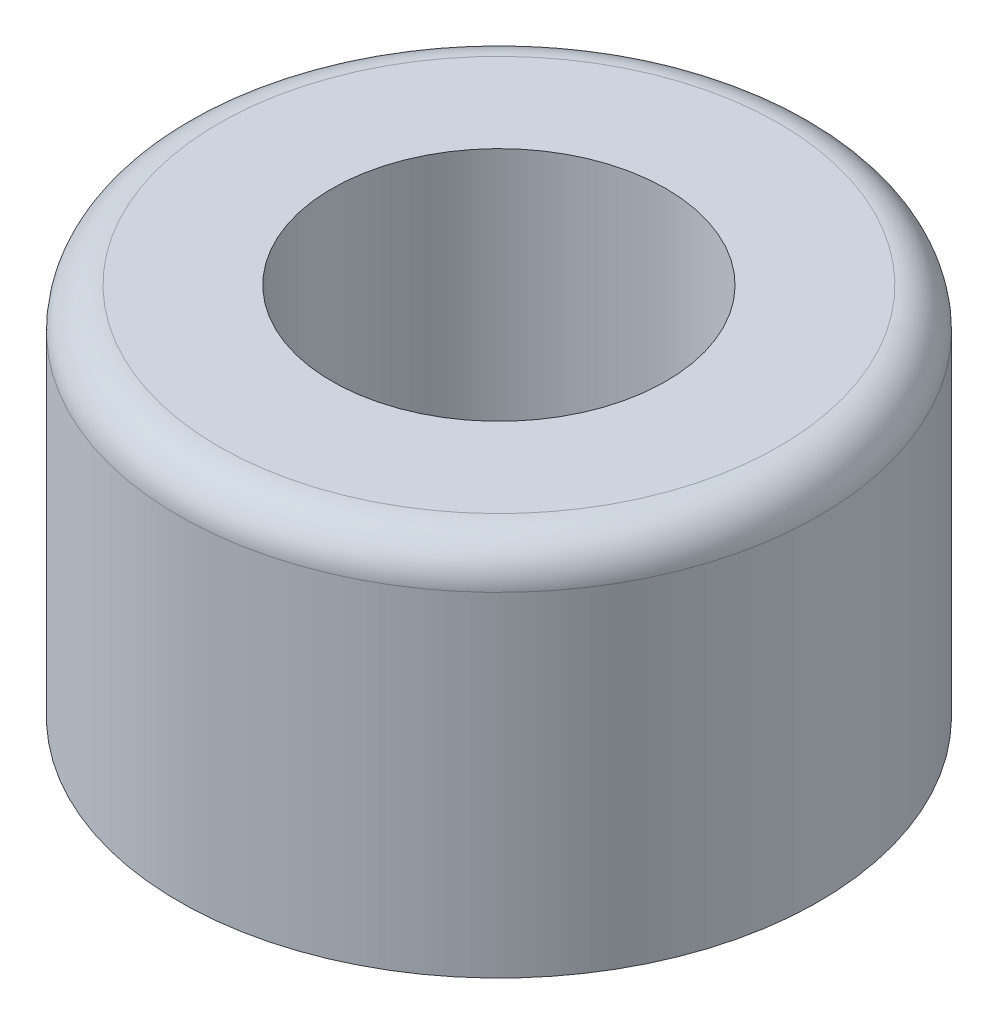
ISO-10303-21;
HEADER;
FILE_DESCRIPTION(('STEP AP214'),'2;1');
FILE_NAME('part.step','',(''),(''),'','','');
FILE_SCHEMA(('AUTOMOTIVE_DESIGN { 1 0 10303 214 1 1 1 1 }'));
ENDSEC;
DATA;
#1=APPLICATION_CONTEXT('core data for automotive mechanical design processes');
#2=APPLICATION_PROTOCOL_DEFINITION('international standard','automotive_design',2000,#1);
#3=PRODUCT_CONTEXT('',#1,'mechanical');
#4=PRODUCT('Part','Part','',(#3));
#5=PRODUCT_RELATED_PRODUCT_CATEGORY('part','',(#4));
#6=PRODUCT_DEFINITION_FORMATION('','',#4);
#7=PRODUCT_DEFINITION_CONTEXT('part definition',#1,'design');
#8=PRODUCT_DEFINITION('design','',#6,#7);
#9=PRODUCT_DEFINITION_SHAPE('','',#8);
#10=(LENGTH_UNIT() NAMED_UNIT(*) SI_UNIT(.MILLI.,.METRE.));
#11=(NAMED_UNIT(*) PLANE_ANGLE_UNIT() SI_UNIT($,.RADIAN.));
#12=(NAMED_UNIT(*) SI_UNIT($,.STERADIAN.) SOLID_ANGLE_UNIT());
#13=UNCERTAINTY_MEASURE_WITH_UNIT(LENGTH_MEASURE(1.E-05),#10,'distance_accuracy_value','');
#14=(GEOMETRIC_REPRESENTATION_CONTEXT(3) GLOBAL_UNCERTAINTY_ASSIGNED_CONTEXT((#13)) GLOBAL_UNIT_ASSIGNED_CONTEXT((#10,
#11,#12)) REPRESENTATION_CONTEXT('',''));
#15=CARTESIAN_POINT('',(0.,0.,0.));
#16=DIRECTION('',(0.,0.,1.));
#17=DIRECTION('',(1.,0.,0.));
#18=AXIS2_PLACEMENT_3D('',#15,#16,#17);
#19=CARTESIAN_POINT('',(0.,2.3749,0.));
#20=DIRECTION('',(0.,1.,0.));
#21=DIRECTION('',(0.,0.,1.));
#22=AXIS2_PLACEMENT_3D('',#19,#20,#21);
#23=PLANE('',#22);
#24=CARTESIAN_POINT('',(0.,2.3749,0.));
#25=DIRECTION('',(0.,-1.,0.));
#26=DIRECTION('',(0.,0.,-1.));
#27=AXIS2_PLACEMENT_3D('',#24,#25,#26);
#28=CIRCLE('',#27,2.1209);
#29=CARTESIAN_POINT('',(0.,2.3749,-2.1209));
#30=VERTEX_POINT('',#29);
#31=EDGE_CURVE('E40',#30,#30,#28,.T.);
#32=ORIENTED_EDGE('',*,*,#31,.T.);
#33=EDGE_LOOP('',(#32));
#34=FACE_BOUND('',#33,.T.);
#35=CARTESIAN_POINT('',(0.,2.3749,0.));
#36=DIRECTION('',(0.,-1.,0.));
#37=DIRECTION('',(0.,0.,-1.));
#38=AXIS2_PLACEMENT_3D('',#35,#36,#37);
#39=CIRCLE('',#38,3.556);
#40=CARTESIAN_POINT('',(0.,2.3749,-3.556));
#41=VERTEX_POINT('',#40);
#42=CARTESIAN_POINT('',(0.,2.3749,3.556));
#43=VERTEX_POINT('',#42);
#44=EDGE_CURVE('E34',#41,#43,#39,.T.);
#45=ORIENTED_EDGE('',*,*,#44,.F.);
#46=CARTESIAN_POINT('',(0.,2.3749,0.));
#47=DIRECTION('',(0.,-1.,0.));
#48=DIRECTION('',(0.,0.,1.));
#49=AXIS2_PLACEMENT_3D('',#46,#47,#48);
#50=CIRCLE('',#49,3.556);
#51=EDGE_CURVE('E38',#43,#41,#50,.T.);
#52=ORIENTED_EDGE('',*,*,#51,.F.);
#53=EDGE_LOOP('',(#45,#52));
#54=FACE_BOUND('',#53,.T.);
#55=ADVANCED_FACE('F16',(#34,#54),#23,.T.);
#56=CARTESIAN_POINT('',(0.,2.3749,0.));
#57=DIRECTION('',(0.,-1.,0.));
#58=DIRECTION('',(0.,0.,-1.));
#59=AXIS2_PLACEMENT_3D('',#56,#57,#58);
#60=CYLINDRICAL_SURFACE('',#59,2.1209);
#61=CARTESIAN_POINT('',(0.,-2.3749,0.));
#62=DIRECTION('',(0.,-1.,0.));
#63=DIRECTION('',(0.,0.,-1.));
#64=AXIS2_PLACEMENT_3D('',#61,#62,#63);
#65=CIRCLE('',#64,2.1209);
#66=CARTESIAN_POINT('',(0.,-2.3749,-2.1209));
#67=VERTEX_POINT('',#66);
#68=EDGE_CURVE('E45',#67,#67,#65,.T.);
#69=ORIENTED_EDGE('',*,*,#68,.T.);
#70=EDGE_LOOP('',(#69));
#71=FACE_BOUND('',#70,.T.);
#72=ORIENTED_EDGE('',*,*,#31,.F.);
#73=EDGE_LOOP('',(#72));
#74=FACE_BOUND('',#73,.T.);
#75=ADVANCED_FACE('F62',(#71,#74),#60,.F.);
#76=CARTESIAN_POINT('',(0.,1.8669,0.));
#77=DIRECTION('',(0.,1.,0.));
#78=DIRECTION('',(0.,0.,1.));
#79=AXIS2_PLACEMENT_3D('',#76,#77,#78);
#80=TOROIDAL_SURFACE('',#79,3.556,0.508);
#81=CARTESIAN_POINT('',(0.,1.8669,0.));
#82=DIRECTION('',(0.,-1.,0.));
#83=DIRECTION('',(0.,0.,-1.));
#84=AXIS2_PLACEMENT_3D('',#81,#82,#83);
#85=CIRCLE('',#84,4.064);
#86=CARTESIAN_POINT('',(0.,1.8669,-4.064));
#87=VERTEX_POINT('',#86);
#88=EDGE_CURVE('E28',#87,#87,#85,.T.);
#89=ORIENTED_EDGE('',*,*,#88,.F.);
#90=EDGE_LOOP('',(#89));
#91=FACE_BOUND('',#90,.T.);
#92=ORIENTED_EDGE('',*,*,#51,.T.);
#93=ORIENTED_EDGE('',*,*,#44,.T.);
#94=EDGE_LOOP('',(#92,#93));
#95=FACE_BOUND('',#94,.T.);
#96=ADVANCED_FACE('F44',(#91,#95),#80,.T.);
#97=CARTESIAN_POINT('',(0.,-2.3749,0.));
#98=DIRECTION('',(0.,1.,0.));
#99=DIRECTION('',(0.,0.,1.));
#100=AXIS2_PLACEMENT_3D('',#97,#98,#99);
#101=PLANE('',#100);
#102=ORIENTED_EDGE('',*,*,#68,.F.);
#103=EDGE_LOOP('',(#102));
#104=FACE_BOUND('',#103,.T.);
#105=CARTESIAN_POINT('',(0.,-2.3749,0.));
#106=DIRECTION('',(0.,-1.,0.));
#107=DIRECTION('',(0.,0.,-1.));
#108=AXIS2_PLACEMENT_3D('',#105,#106,#107);
#109=CIRCLE('',#108,4.064);
#110=CARTESIAN_POINT('',(0.,-2.3749,-4.064));
#111=VERTEX_POINT('',#110);
#112=EDGE_CURVE('E11',#111,#111,#109,.F.);
#113=ORIENTED_EDGE('',*,*,#112,.F.);
#114=EDGE_LOOP('',(#113));
#115=FACE_BOUND('',#114,.T.);
#116=ADVANCED_FACE('F61',(#104,#115),#101,.F.);
#117=CARTESIAN_POINT('',(0.,2.3749,0.));
#118=DIRECTION('',(0.,-1.,0.));
#119=DIRECTION('',(0.,0.,-1.));
#120=AXIS2_PLACEMENT_3D('',#117,#118,#119);
#121=CYLINDRICAL_SURFACE('',#120,4.064);
#122=ORIENTED_EDGE('',*,*,#88,.T.);
#123=EDGE_LOOP('',(#122));
#124=FACE_BOUND('',#123,.T.);
#125=ORIENTED_EDGE('',*,*,#112,.T.);
#126=EDGE_LOOP('',(#125));
#127=FACE_BOUND('',#126,.T.);
#128=ADVANCED_FACE('F84',(#124,#127),#121,.T.);
#129=CLOSED_SHELL('',(#55,#75,#96,#116,#128));
#130=MANIFOLD_SOLID_BREP('B1',#129);
#131=ADVANCED_BREP_SHAPE_REPRESENTATION('',(#18,#130),#14);
#132=SHAPE_DEFINITION_REPRESENTATION(#9,#131);
ENDSEC;
END-ISO-10303-21;
